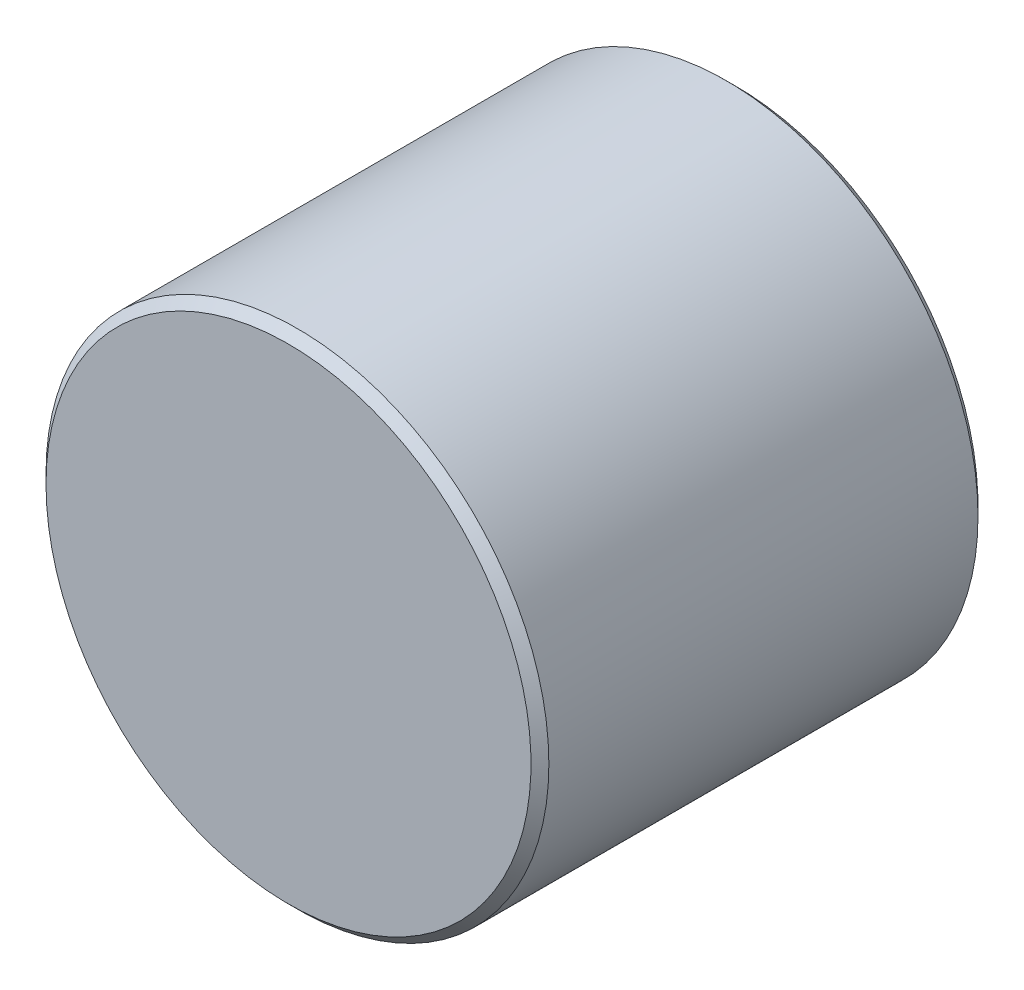
ISO-10303-21;
HEADER;
FILE_DESCRIPTION(('STEP AP214'),'2;1');
FILE_NAME('part.step','',(''),(''),'','','');
FILE_SCHEMA(('AUTOMOTIVE_DESIGN { 1 0 10303 214 1 1 1 1 }'));
ENDSEC;
DATA;
#1=APPLICATION_CONTEXT('core data for automotive mechanical design processes');
#2=APPLICATION_PROTOCOL_DEFINITION('international standard','automotive_design',2000,#1);
#3=PRODUCT_CONTEXT('',#1,'mechanical');
#4=PRODUCT('Part','Part','',(#3));
#5=PRODUCT_RELATED_PRODUCT_CATEGORY('part','',(#4));
#6=PRODUCT_DEFINITION_FORMATION('','',#4);
#7=PRODUCT_DEFINITION_CONTEXT('part definition',#1,'design');
#8=PRODUCT_DEFINITION('design','',#6,#7);
#9=PRODUCT_DEFINITION_SHAPE('','',#8);
#10=(LENGTH_UNIT() NAMED_UNIT(*) SI_UNIT(.MILLI.,.METRE.));
#11=(NAMED_UNIT(*) PLANE_ANGLE_UNIT() SI_UNIT($,.RADIAN.));
#12=(NAMED_UNIT(*) SI_UNIT($,.STERADIAN.) SOLID_ANGLE_UNIT());
#13=UNCERTAINTY_MEASURE_WITH_UNIT(LENGTH_MEASURE(1.E-05),#10,'distance_accuracy_value','');
#14=(GEOMETRIC_REPRESENTATION_CONTEXT(3) GLOBAL_UNCERTAINTY_ASSIGNED_CONTEXT((#13)) GLOBAL_UNIT_ASSIGNED_CONTEXT((#10,
#11,#12)) REPRESENTATION_CONTEXT('',''));
#15=CARTESIAN_POINT('',(0.,0.,0.));
#16=DIRECTION('',(0.,0.,1.));
#17=DIRECTION('',(1.,0.,0.));
#18=AXIS2_PLACEMENT_3D('',#15,#16,#17);
#19=CARTESIAN_POINT('',(0.,0.,12.4460000000028));
#20=DIRECTION('',(0.,0.,-1.));
#21=DIRECTION('',(-1.,0.,0.));
#22=AXIS2_PLACEMENT_3D('',#19,#20,#21);
#23=CONICAL_SURFACE('',#22,7.14374999999969,0.785398163397447);
#24=CARTESIAN_POINT('',(0.,0.,12.7000000000006));
#25=DIRECTION('',(0.,0.,-1.));
#26=DIRECTION('',(-1.,0.,0.));
#27=AXIS2_PLACEMENT_3D('',#24,#25,#26);
#28=CIRCLE('',#27,6.88975000000194);
#29=CARTESIAN_POINT('',(-6.88975000000194,0.,12.7000000000006));
#30=VERTEX_POINT('',#29);
#31=EDGE_CURVE('E45',#30,#30,#28,.T.);
#32=ORIENTED_EDGE('',*,*,#31,.T.);
#33=EDGE_LOOP('',(#32));
#34=FACE_BOUND('',#33,.T.);
#35=CARTESIAN_POINT('',(0.,0.,12.4460000000028));
#36=DIRECTION('',(0.,0.,-1.));
#37=DIRECTION('',(-1.,0.,0.));
#38=AXIS2_PLACEMENT_3D('',#35,#36,#37);
#39=CIRCLE('',#38,7.14374999999969);
#40=CARTESIAN_POINT('',(-7.14374999999969,0.,12.4460000000028));
#41=VERTEX_POINT('',#40);
#42=EDGE_CURVE('E10',#41,#41,#39,.T.);
#43=ORIENTED_EDGE('',*,*,#42,.F.);
#44=EDGE_LOOP('',(#43));
#45=FACE_BOUND('',#44,.T.);
#46=ADVANCED_FACE('F31',(#34,#45),#23,.T.);
#47=CARTESIAN_POINT('',(0.,0.,12.7000000000006));
#48=DIRECTION('',(0.,0.,-1.));
#49=DIRECTION('',(-1.,0.,0.));
#50=AXIS2_PLACEMENT_3D('',#47,#48,#49);
#51=CYLINDRICAL_SURFACE('',#50,7.14374999999969);
#52=ORIENTED_EDGE('',*,*,#42,.T.);
#53=EDGE_LOOP('',(#52));
#54=FACE_BOUND('',#53,.T.);
#55=CARTESIAN_POINT('',(0.,0.,0.253999999999871));
#56=DIRECTION('',(0.,0.,-1.));
#57=DIRECTION('',(-1.,0.,0.));
#58=AXIS2_PLACEMENT_3D('',#55,#56,#57);
#59=CIRCLE('',#58,7.14374999999969);
#60=CARTESIAN_POINT('',(-7.14374999999969,0.,0.25399999999987));
#61=VERTEX_POINT('',#60);
#62=EDGE_CURVE('E37',#61,#61,#59,.T.);
#63=ORIENTED_EDGE('',*,*,#62,.F.);
#64=EDGE_LOOP('',(#63));
#65=FACE_BOUND('',#64,.T.);
#66=ADVANCED_FACE('F64',(#54,#65),#51,.T.);
#67=CARTESIAN_POINT('',(0.,0.,0.));
#68=DIRECTION('',(0.,0.,1.));
#69=DIRECTION('',(1.,0.,0.));
#70=AXIS2_PLACEMENT_3D('',#67,#68,#69);
#71=CONICAL_SURFACE('',#70,6.88974999999982,0.785398163397447);
#72=ORIENTED_EDGE('',*,*,#62,.T.);
#73=EDGE_LOOP('',(#72));
#74=FACE_BOUND('',#73,.T.);
#75=CARTESIAN_POINT('',(0.,0.,0.));
#76=DIRECTION('',(0.,0.,-1.));
#77=DIRECTION('',(-1.,0.,0.));
#78=AXIS2_PLACEMENT_3D('',#75,#76,#77);
#79=CIRCLE('',#78,6.88974999999982);
#80=CARTESIAN_POINT('',(-6.88974999999982,0.,0.));
#81=VERTEX_POINT('',#80);
#82=EDGE_CURVE('E41',#81,#81,#79,.T.);
#83=ORIENTED_EDGE('',*,*,#82,.F.);
#84=EDGE_LOOP('',(#83));
#85=FACE_BOUND('',#84,.T.);
#86=ADVANCED_FACE('F60',(#74,#85),#71,.T.);
#87=CARTESIAN_POINT('',(0.,0.,0.));
#88=DIRECTION('',(0.,0.,-1.));
#89=DIRECTION('',(-1.,0.,0.));
#90=AXIS2_PLACEMENT_3D('',#87,#88,#89);
#91=PLANE('',#90);
#92=ORIENTED_EDGE('',*,*,#82,.T.);
#93=EDGE_LOOP('',(#92));
#94=FACE_BOUND('',#93,.T.);
#95=ADVANCED_FACE('F55',(#94),#91,.T.);
#96=CARTESIAN_POINT('',(6.88975000000193,0.,12.7000000000006));
#97=DIRECTION('',(0.,0.,1.));
#98=DIRECTION('',(1.,0.,0.));
#99=AXIS2_PLACEMENT_3D('',#96,#97,#98);
#100=PLANE('',#99);
#101=ORIENTED_EDGE('',*,*,#31,.F.);
#102=EDGE_LOOP('',(#101));
#103=FACE_BOUND('',#102,.T.);
#104=ADVANCED_FACE('F53',(#103),#100,.T.);
#105=CLOSED_SHELL('',(#46,#66,#86,#95,#104));
#106=MANIFOLD_SOLID_BREP('B2',#105);
#107=ADVANCED_BREP_SHAPE_REPRESENTATION('',(#18,#106),#14);
#108=SHAPE_DEFINITION_REPRESENTATION(#9,#107);
ENDSEC;
END-ISO-10303-21;
